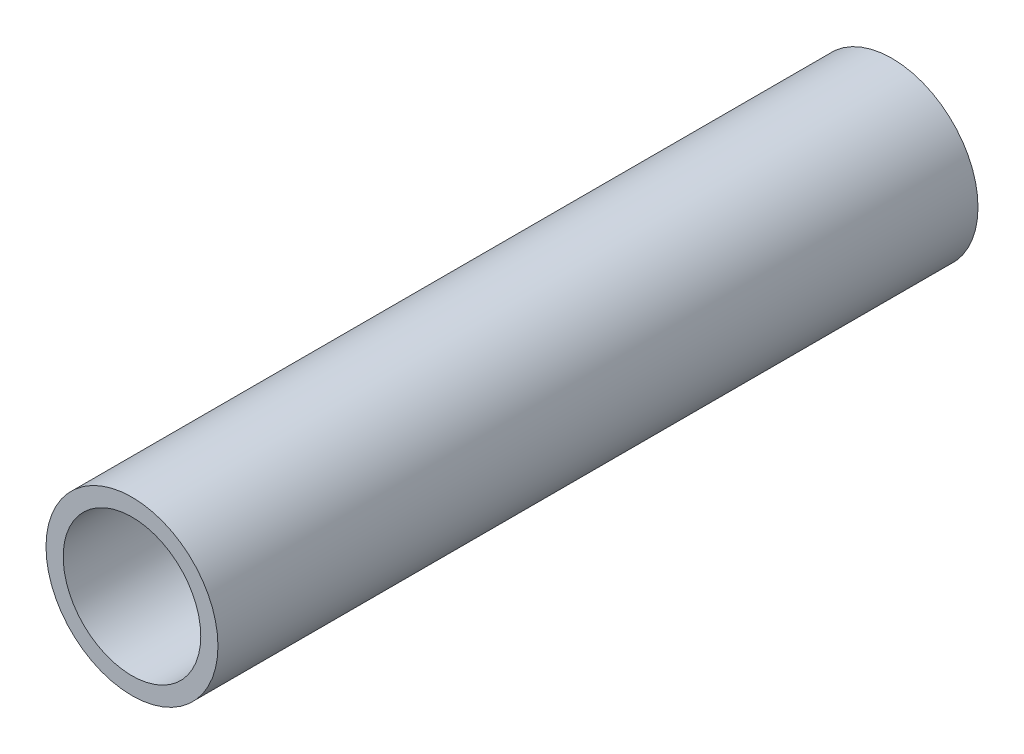
ISO-10303-21;
HEADER;
FILE_DESCRIPTION(('STEP AP214'),'2;1');
FILE_NAME('part.step','',(''),(''),'','','');
FILE_SCHEMA(('AUTOMOTIVE_DESIGN { 1 0 10303 214 1 1 1 1 }'));
ENDSEC;
DATA;
#1=APPLICATION_CONTEXT('core data for automotive mechanical design processes');
#2=APPLICATION_PROTOCOL_DEFINITION('international standard','automotive_design',2000,#1);
#3=PRODUCT_CONTEXT('',#1,'mechanical');
#4=PRODUCT('Part','Part','',(#3));
#5=PRODUCT_RELATED_PRODUCT_CATEGORY('part','',(#4));
#6=PRODUCT_DEFINITION_FORMATION('','',#4);
#7=PRODUCT_DEFINITION_CONTEXT('part definition',#1,'design');
#8=PRODUCT_DEFINITION('design','',#6,#7);
#9=PRODUCT_DEFINITION_SHAPE('','',#8);
#10=(LENGTH_UNIT() NAMED_UNIT(*) SI_UNIT(.MILLI.,.METRE.));
#11=(NAMED_UNIT(*) PLANE_ANGLE_UNIT() SI_UNIT($,.RADIAN.));
#12=(NAMED_UNIT(*) SI_UNIT($,.STERADIAN.) SOLID_ANGLE_UNIT());
#13=UNCERTAINTY_MEASURE_WITH_UNIT(LENGTH_MEASURE(1.E-05),#10,'distance_accuracy_value','');
#14=(GEOMETRIC_REPRESENTATION_CONTEXT(3) GLOBAL_UNCERTAINTY_ASSIGNED_CONTEXT((#13)) GLOBAL_UNIT_ASSIGNED_CONTEXT((#10,
#11,#12)) REPRESENTATION_CONTEXT('',''));
#15=CARTESIAN_POINT('',(0.,0.,0.));
#16=DIRECTION('',(0.,0.,1.));
#17=DIRECTION('',(1.,0.,0.));
#18=AXIS2_PLACEMENT_3D('',#15,#16,#17);
#19=CARTESIAN_POINT('',(0.,0.,44.2));
#20=DIRECTION('',(0.,0.,1.));
#21=DIRECTION('',(1.,0.,0.));
#22=AXIS2_PLACEMENT_3D('',#19,#20,#21);
#23=PLANE('',#22);
#24=CARTESIAN_POINT('',(0.,0.,44.2));
#25=DIRECTION('',(0.,0.,1.));
#26=DIRECTION('',(1.,0.,0.));
#27=AXIS2_PLACEMENT_3D('',#24,#25,#26);
#28=CIRCLE('',#27,5.);
#29=CARTESIAN_POINT('',(5.,0.,44.2));
#30=VERTEX_POINT('',#29);
#31=EDGE_CURVE('E10',#30,#30,#28,.T.);
#32=ORIENTED_EDGE('',*,*,#31,.T.);
#33=EDGE_LOOP('',(#32));
#34=FACE_BOUND('',#33,.T.);
#35=CARTESIAN_POINT('',(0.,0.,44.2));
#36=DIRECTION('',(0.,0.,1.));
#37=DIRECTION('',(1.,0.,0.));
#38=AXIS2_PLACEMENT_3D('',#35,#36,#37);
#39=CIRCLE('',#38,4.);
#40=CARTESIAN_POINT('',(4.,0.,44.2));
#41=VERTEX_POINT('',#40);
#42=EDGE_CURVE('E50',#41,#41,#39,.T.);
#43=ORIENTED_EDGE('',*,*,#42,.F.);
#44=EDGE_LOOP('',(#43));
#45=FACE_BOUND('',#44,.T.);
#46=ADVANCED_FACE('F37',(#34,#45),#23,.T.);
#47=CARTESIAN_POINT('',(0.,0.,0.));
#48=DIRECTION('',(0.,0.,1.));
#49=DIRECTION('',(1.,0.,0.));
#50=AXIS2_PLACEMENT_3D('',#47,#48,#49);
#51=PLANE('',#50);
#52=CARTESIAN_POINT('',(0.,0.,0.));
#53=DIRECTION('',(0.,0.,1.));
#54=DIRECTION('',(1.,0.,0.));
#55=AXIS2_PLACEMENT_3D('',#52,#53,#54);
#56=CIRCLE('',#55,5.);
#57=CARTESIAN_POINT('',(5.,0.,0.));
#58=VERTEX_POINT('',#57);
#59=EDGE_CURVE('E41',#58,#58,#56,.T.);
#60=ORIENTED_EDGE('',*,*,#59,.F.);
#61=EDGE_LOOP('',(#60));
#62=FACE_BOUND('',#61,.T.);
#63=CARTESIAN_POINT('',(0.,0.,0.));
#64=DIRECTION('',(0.,0.,1.));
#65=DIRECTION('',(1.,0.,0.));
#66=AXIS2_PLACEMENT_3D('',#63,#64,#65);
#67=CIRCLE('',#66,4.);
#68=CARTESIAN_POINT('',(4.,0.,0.));
#69=VERTEX_POINT('',#68);
#70=EDGE_CURVE('E52',#69,#69,#67,.T.);
#71=ORIENTED_EDGE('',*,*,#70,.T.);
#72=EDGE_LOOP('',(#71));
#73=FACE_BOUND('',#72,.T.);
#74=ADVANCED_FACE('F64',(#62,#73),#51,.F.);
#75=CARTESIAN_POINT('',(0.,0.,44.2));
#76=DIRECTION('',(0.,0.,-1.));
#77=DIRECTION('',(-1.,0.,0.));
#78=AXIS2_PLACEMENT_3D('',#75,#76,#77);
#79=CYLINDRICAL_SURFACE('',#78,5.);
#80=ORIENTED_EDGE('',*,*,#31,.F.);
#81=EDGE_LOOP('',(#80));
#82=FACE_BOUND('',#81,.T.);
#83=ORIENTED_EDGE('',*,*,#59,.T.);
#84=EDGE_LOOP('',(#83));
#85=FACE_BOUND('',#84,.T.);
#86=ADVANCED_FACE('F39',(#82,#85),#79,.T.);
#87=CARTESIAN_POINT('',(0.,0.,44.2));
#88=DIRECTION('',(0.,0.,-1.));
#89=DIRECTION('',(-1.,0.,0.));
#90=AXIS2_PLACEMENT_3D('',#87,#88,#89);
#91=CYLINDRICAL_SURFACE('',#90,4.);
#92=ORIENTED_EDGE('',*,*,#42,.T.);
#93=EDGE_LOOP('',(#92));
#94=FACE_BOUND('',#93,.T.);
#95=ORIENTED_EDGE('',*,*,#70,.F.);
#96=EDGE_LOOP('',(#95));
#97=FACE_BOUND('',#96,.T.);
#98=ADVANCED_FACE('F60',(#94,#97),#91,.F.);
#99=CLOSED_SHELL('',(#46,#74,#86,#98));
#100=MANIFOLD_SOLID_BREP('B2',#99);
#101=ADVANCED_BREP_SHAPE_REPRESENTATION('',(#18,#100),#14);
#102=SHAPE_DEFINITION_REPRESENTATION(#9,#101);
ENDSEC;
END-ISO-10303-21;
